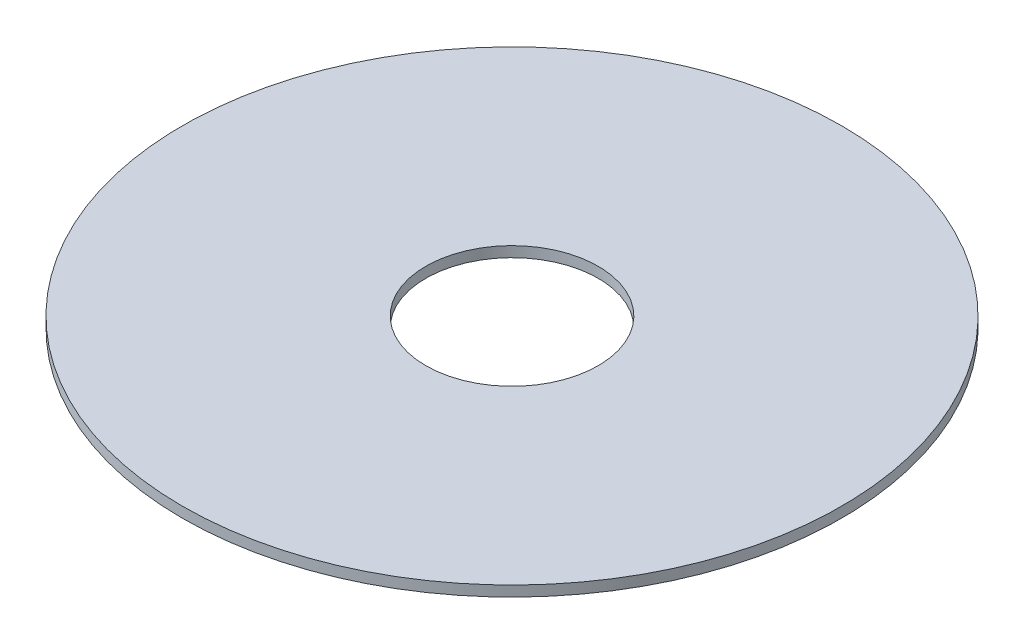
ISO-10303-21;
HEADER;
FILE_DESCRIPTION(('STEP AP214'),'2;1');
FILE_NAME('part.step','',(''),(''),'','','');
FILE_SCHEMA(('AUTOMOTIVE_DESIGN { 1 0 10303 214 1 1 1 1 }'));
ENDSEC;
DATA;
#1=APPLICATION_CONTEXT('core data for automotive mechanical design processes');
#2=APPLICATION_PROTOCOL_DEFINITION('international standard','automotive_design',2000,#1);
#3=PRODUCT_CONTEXT('',#1,'mechanical');
#4=PRODUCT('Part','Part','',(#3));
#5=PRODUCT_RELATED_PRODUCT_CATEGORY('part','',(#4));
#6=PRODUCT_DEFINITION_FORMATION('','',#4);
#7=PRODUCT_DEFINITION_CONTEXT('part definition',#1,'design');
#8=PRODUCT_DEFINITION('design','',#6,#7);
#9=PRODUCT_DEFINITION_SHAPE('','',#8);
#10=(LENGTH_UNIT() NAMED_UNIT(*) SI_UNIT(.MILLI.,.METRE.));
#11=(NAMED_UNIT(*) PLANE_ANGLE_UNIT() SI_UNIT($,.RADIAN.));
#12=(NAMED_UNIT(*) SI_UNIT($,.STERADIAN.) SOLID_ANGLE_UNIT());
#13=UNCERTAINTY_MEASURE_WITH_UNIT(LENGTH_MEASURE(1.E-05),#10,'distance_accuracy_value','');
#14=(GEOMETRIC_REPRESENTATION_CONTEXT(3) GLOBAL_UNCERTAINTY_ASSIGNED_CONTEXT((#13)) GLOBAL_UNIT_ASSIGNED_CONTEXT((#10,
#11,#12)) REPRESENTATION_CONTEXT('',''));
#15=CARTESIAN_POINT('',(0.,0.,0.));
#16=DIRECTION('',(0.,0.,1.));
#17=DIRECTION('',(1.,0.,0.));
#18=AXIS2_PLACEMENT_3D('',#15,#16,#17);
#19=CARTESIAN_POINT('',(0.,1.7,0.));
#20=DIRECTION('',(0.,1.,0.));
#21=DIRECTION('',(0.,0.,1.));
#22=AXIS2_PLACEMENT_3D('',#19,#20,#21);
#23=PLANE('',#22);
#24=CARTESIAN_POINT('',(0.,1.7,0.));
#25=DIRECTION('',(0.,1.,0.));
#26=DIRECTION('',(0.,0.,1.));
#27=AXIS2_PLACEMENT_3D('',#24,#25,#26);
#28=CIRCLE('',#27,53.5344);
#29=CARTESIAN_POINT('',(0.,1.7,53.5344));
#30=VERTEX_POINT('',#29);
#31=EDGE_CURVE('E10',#30,#30,#28,.T.);
#32=ORIENTED_EDGE('',*,*,#31,.T.);
#33=EDGE_LOOP('',(#32));
#34=FACE_BOUND('',#33,.T.);
#35=CARTESIAN_POINT('',(0.,1.7,0.));
#36=DIRECTION('',(0.,1.,0.));
#37=DIRECTION('',(0.,0.,1.));
#38=AXIS2_PLACEMENT_3D('',#35,#36,#37);
#39=CIRCLE('',#38,14.);
#40=CARTESIAN_POINT('',(0.,1.7,14.));
#41=VERTEX_POINT('',#40);
#42=EDGE_CURVE('E42',#41,#41,#39,.T.);
#43=ORIENTED_EDGE('',*,*,#42,.F.);
#44=EDGE_LOOP('',(#43));
#45=FACE_BOUND('',#44,.T.);
#46=ADVANCED_FACE('F31',(#34,#45),#23,.T.);
#47=CARTESIAN_POINT('',(0.,0.,0.));
#48=DIRECTION('',(0.,1.,0.));
#49=DIRECTION('',(0.,0.,1.));
#50=AXIS2_PLACEMENT_3D('',#47,#48,#49);
#51=PLANE('',#50);
#52=CARTESIAN_POINT('',(0.,0.,0.));
#53=DIRECTION('',(0.,1.,0.));
#54=DIRECTION('',(0.,0.,1.));
#55=AXIS2_PLACEMENT_3D('',#52,#53,#54);
#56=CIRCLE('',#55,53.5344);
#57=CARTESIAN_POINT('',(0.,0.,53.5344));
#58=VERTEX_POINT('',#57);
#59=EDGE_CURVE('E35',#58,#58,#56,.T.);
#60=ORIENTED_EDGE('',*,*,#59,.F.);
#61=EDGE_LOOP('',(#60));
#62=FACE_BOUND('',#61,.T.);
#63=CARTESIAN_POINT('',(0.,0.,0.));
#64=DIRECTION('',(0.,1.,0.));
#65=DIRECTION('',(0.,0.,1.));
#66=AXIS2_PLACEMENT_3D('',#63,#64,#65);
#67=CIRCLE('',#66,14.);
#68=CARTESIAN_POINT('',(0.,0.,14.));
#69=VERTEX_POINT('',#68);
#70=EDGE_CURVE('E44',#69,#69,#67,.T.);
#71=ORIENTED_EDGE('',*,*,#70,.T.);
#72=EDGE_LOOP('',(#71));
#73=FACE_BOUND('',#72,.T.);
#74=ADVANCED_FACE('F54',(#62,#73),#51,.F.);
#75=CARTESIAN_POINT('',(0.,1.7,0.));
#76=DIRECTION('',(0.,-1.,0.));
#77=DIRECTION('',(0.,0.,-1.));
#78=AXIS2_PLACEMENT_3D('',#75,#76,#77);
#79=CYLINDRICAL_SURFACE('',#78,53.5344);
#80=ORIENTED_EDGE('',*,*,#31,.F.);
#81=EDGE_LOOP('',(#80));
#82=FACE_BOUND('',#81,.T.);
#83=ORIENTED_EDGE('',*,*,#59,.T.);
#84=EDGE_LOOP('',(#83));
#85=FACE_BOUND('',#84,.T.);
#86=ADVANCED_FACE('F33',(#82,#85),#79,.T.);
#87=CARTESIAN_POINT('',(0.,1.7,0.));
#88=DIRECTION('',(0.,-1.,0.));
#89=DIRECTION('',(0.,0.,-1.));
#90=AXIS2_PLACEMENT_3D('',#87,#88,#89);
#91=CYLINDRICAL_SURFACE('',#90,14.);
#92=ORIENTED_EDGE('',*,*,#42,.T.);
#93=EDGE_LOOP('',(#92));
#94=FACE_BOUND('',#93,.T.);
#95=ORIENTED_EDGE('',*,*,#70,.F.);
#96=EDGE_LOOP('',(#95));
#97=FACE_BOUND('',#96,.T.);
#98=ADVANCED_FACE('F50',(#94,#97),#91,.F.);
#99=CLOSED_SHELL('',(#46,#74,#86,#98));
#100=MANIFOLD_SOLID_BREP('B2',#99);
#101=ADVANCED_BREP_SHAPE_REPRESENTATION('',(#18,#100),#14);
#102=SHAPE_DEFINITION_REPRESENTATION(#9,#101);
ENDSEC;
END-ISO-10303-21;
